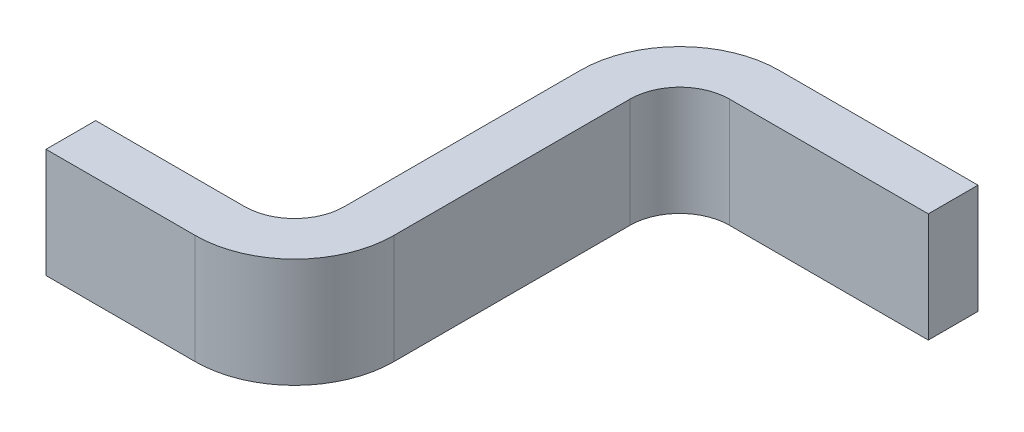
ISO-10303-21;
HEADER;
FILE_DESCRIPTION(('STEP AP214'),'2;1');
FILE_NAME('part.step','',(''),(''),'','','');
FILE_SCHEMA(('AUTOMOTIVE_DESIGN { 1 0 10303 214 1 1 1 1 }'));
ENDSEC;
DATA;
#1=APPLICATION_CONTEXT('core data for automotive mechanical design processes');
#2=APPLICATION_PROTOCOL_DEFINITION('international standard','automotive_design',2000,#1);
#3=PRODUCT_CONTEXT('',#1,'mechanical');
#4=PRODUCT('Part','Part','',(#3));
#5=PRODUCT_RELATED_PRODUCT_CATEGORY('part','',(#4));
#6=PRODUCT_DEFINITION_FORMATION('','',#4);
#7=PRODUCT_DEFINITION_CONTEXT('part definition',#1,'design');
#8=PRODUCT_DEFINITION('design','',#6,#7);
#9=PRODUCT_DEFINITION_SHAPE('','',#8);
#10=(LENGTH_UNIT() NAMED_UNIT(*) SI_UNIT(.MILLI.,.METRE.));
#11=(NAMED_UNIT(*) PLANE_ANGLE_UNIT() SI_UNIT($,.RADIAN.));
#12=(NAMED_UNIT(*) SI_UNIT($,.STERADIAN.) SOLID_ANGLE_UNIT());
#13=UNCERTAINTY_MEASURE_WITH_UNIT(LENGTH_MEASURE(1.E-05),#10,'distance_accuracy_value','');
#14=(GEOMETRIC_REPRESENTATION_CONTEXT(3) GLOBAL_UNCERTAINTY_ASSIGNED_CONTEXT((#13)) GLOBAL_UNIT_ASSIGNED_CONTEXT((#10,
#11,#12)) REPRESENTATION_CONTEXT('',''));
#15=CARTESIAN_POINT('',(0.,0.,0.));
#16=DIRECTION('',(0.,0.,1.));
#17=DIRECTION('',(1.,0.,0.));
#18=AXIS2_PLACEMENT_3D('',#15,#16,#17);
#19=CARTESIAN_POINT('',(3.90000000000001,-1.64,0.675));
#20=DIRECTION('',(0.,-1.,0.));
#21=DIRECTION('',(0.,0.,-1.));
#22=AXIS2_PLACEMENT_3D('',#19,#20,#21);
#23=PLANE('',#22);
#24=CARTESIAN_POINT('',(3.8,-1.64,0.675));
#25=DIRECTION('',(0.,-1.,0.));
#26=DIRECTION('',(0.,0.,-1.));
#27=AXIS2_PLACEMENT_3D('',#24,#25,#26);
#28=CIRCLE('',#27,0.1);
#29=CARTESIAN_POINT('',(3.90000000000001,-1.64,0.675));
#30=VERTEX_POINT('',#29);
#31=CARTESIAN_POINT('',(3.8,-1.64,0.775));
#32=VERTEX_POINT('',#31);
#33=EDGE_CURVE('E162',#30,#32,#28,.T.);
#34=ORIENTED_EDGE('',*,*,#33,.T.);
#35=DIRECTION('',(1.,0.,0.));
#36=VECTOR('',#35,1.);
#37=CARTESIAN_POINT('',(3.50000000000001,-1.64,0.775));
#38=LINE('',#37,#36);
#39=CARTESIAN_POINT('',(3.50000000000001,-1.64,0.775));
#40=VERTEX_POINT('',#39);
#41=EDGE_CURVE('E120',#32,#40,#38,.F.);
#42=ORIENTED_EDGE('',*,*,#41,.T.);
#43=DIRECTION('',(0.,0.,1.));
#44=VECTOR('',#43,1.);
#45=CARTESIAN_POINT('',(3.50000000000001,-1.64,0.775));
#46=LINE('',#45,#44);
#47=CARTESIAN_POINT('',(3.50000000000001,-1.64,0.875));
#48=VERTEX_POINT('',#47);
#49=EDGE_CURVE('E116',#48,#40,#46,.F.);
#50=ORIENTED_EDGE('',*,*,#49,.F.);
#51=DIRECTION('',(-1.,0.,0.));
#52=VECTOR('',#51,1.);
#53=CARTESIAN_POINT('',(3.50000000000001,-1.64,0.875));
#54=LINE('',#53,#52);
#55=CARTESIAN_POINT('',(3.8,-1.64,0.875));
#56=VERTEX_POINT('',#55);
#57=EDGE_CURVE('E111',#48,#56,#54,.F.);
#58=ORIENTED_EDGE('',*,*,#57,.T.);
#59=CARTESIAN_POINT('',(3.8,-1.64,0.675));
#60=DIRECTION('',(0.,-1.,0.));
#61=DIRECTION('',(0.,0.,-1.));
#62=AXIS2_PLACEMENT_3D('',#59,#60,#61);
#63=CIRCLE('',#62,0.2);
#64=CARTESIAN_POINT('',(4.,-1.64,0.675));
#65=VERTEX_POINT('',#64);
#66=EDGE_CURVE('E102',#65,#56,#63,.T.);
#67=ORIENTED_EDGE('',*,*,#66,.F.);
#68=DIRECTION('',(0.,0.,1.));
#69=VECTOR('',#68,1.);
#70=CARTESIAN_POINT('',(4.,-1.64,0.675));
#71=LINE('',#70,#69);
#72=CARTESIAN_POINT('',(4.,-1.64,0.2));
#73=VERTEX_POINT('',#72);
#74=EDGE_CURVE('E98',#65,#73,#71,.F.);
#75=ORIENTED_EDGE('',*,*,#74,.T.);
#76=CARTESIAN_POINT('',(4.1,-1.64,0.2));
#77=DIRECTION('',(0.,1.,0.));
#78=DIRECTION('',(0.,0.,1.));
#79=AXIS2_PLACEMENT_3D('',#76,#77,#78);
#80=CIRCLE('',#79,0.1);
#81=CARTESIAN_POINT('',(4.1,-1.64,0.1));
#82=VERTEX_POINT('',#81);
#83=EDGE_CURVE('E20',#73,#82,#80,.F.);
#84=ORIENTED_EDGE('',*,*,#83,.T.);
#85=DIRECTION('',(-1.,0.,0.));
#86=VECTOR('',#85,1.);
#87=CARTESIAN_POINT('',(4.1,-1.64,0.1));
#88=LINE('',#87,#86);
#89=CARTESIAN_POINT('',(4.5,-1.64,0.1));
#90=VERTEX_POINT('',#89);
#91=EDGE_CURVE('E145',#82,#90,#88,.F.);
#92=ORIENTED_EDGE('',*,*,#91,.T.);
#93=DIRECTION('',(0.,0.,1.));
#94=VECTOR('',#93,1.);
#95=CARTESIAN_POINT('',(4.5,-1.64,0.));
#96=LINE('',#95,#94);
#97=CARTESIAN_POINT('',(4.5,-1.64,0.));
#98=VERTEX_POINT('',#97);
#99=EDGE_CURVE('E139',#90,#98,#96,.F.);
#100=ORIENTED_EDGE('',*,*,#99,.T.);
#101=DIRECTION('',(1.,0.,0.));
#102=VECTOR('',#101,1.);
#103=CARTESIAN_POINT('',(4.1,-1.64,0.));
#104=LINE('',#103,#102);
#105=CARTESIAN_POINT('',(4.1,-1.64,0.));
#106=VERTEX_POINT('',#105);
#107=EDGE_CURVE('E132',#98,#106,#104,.F.);
#108=ORIENTED_EDGE('',*,*,#107,.T.);
#109=CARTESIAN_POINT('',(4.1,-1.64,0.2));
#110=DIRECTION('',(0.,1.,0.));
#111=DIRECTION('',(0.,0.,1.));
#112=AXIS2_PLACEMENT_3D('',#109,#110,#111);
#113=CIRCLE('',#112,0.2);
#114=CARTESIAN_POINT('',(3.90000000000001,-1.64,0.2));
#115=VERTEX_POINT('',#114);
#116=EDGE_CURVE('E135',#115,#106,#113,.F.);
#117=ORIENTED_EDGE('',*,*,#116,.F.);
#118=DIRECTION('',(0.,0.,-1.));
#119=VECTOR('',#118,1.);
#120=CARTESIAN_POINT('',(3.90000000000001,-1.64,0.675));
#121=LINE('',#120,#119);
#122=EDGE_CURVE('E128',#115,#30,#121,.F.);
#123=ORIENTED_EDGE('',*,*,#122,.T.);
#124=EDGE_LOOP('',(#34,#42,#50,#58,#67,#75,#84,#92,#100,#108,#117,#123));
#125=FACE_BOUND('',#124,.T.);
#126=ADVANCED_FACE('F17',(#125),#23,.F.);
#127=CARTESIAN_POINT('',(4.1,-1.64,0.2));
#128=DIRECTION('',(0.,1.,0.));
#129=DIRECTION('',(0.,0.,1.));
#130=AXIS2_PLACEMENT_3D('',#127,#128,#129);
#131=CYLINDRICAL_SURFACE('',#130,0.1);
#132=DIRECTION('',(0.,1.,0.));
#133=VECTOR('',#132,1.);
#134=CARTESIAN_POINT('',(4.,-1.64,0.2));
#135=LINE('',#134,#133);
#136=CARTESIAN_POINT('',(4.,-1.86,0.2));
#137=VERTEX_POINT('',#136);
#138=EDGE_CURVE('E91',#73,#137,#135,.F.);
#139=ORIENTED_EDGE('',*,*,#138,.T.);
#140=CARTESIAN_POINT('',(4.1,-1.86,0.2));
#141=DIRECTION('',(0.,1.,0.));
#142=DIRECTION('',(0.,0.,1.));
#143=AXIS2_PLACEMENT_3D('',#140,#141,#142);
#144=CIRCLE('',#143,0.1);
#145=CARTESIAN_POINT('',(4.1,-1.86,0.1));
#146=VERTEX_POINT('',#145);
#147=EDGE_CURVE('E103',#137,#146,#144,.F.);
#148=ORIENTED_EDGE('',*,*,#147,.T.);
#149=DIRECTION('',(0.,1.,0.));
#150=VECTOR('',#149,1.);
#151=CARTESIAN_POINT('',(4.1,-1.64,0.1));
#152=LINE('',#151,#150);
#153=EDGE_CURVE('E92',#146,#82,#152,.T.);
#154=ORIENTED_EDGE('',*,*,#153,.T.);
#155=ORIENTED_EDGE('',*,*,#83,.F.);
#156=EDGE_LOOP('',(#139,#148,#154,#155));
#157=FACE_BOUND('',#156,.T.);
#158=ADVANCED_FACE('F89',(#157),#131,.F.);
#159=CARTESIAN_POINT('',(4.1,-1.64,0.1));
#160=DIRECTION('',(0.,0.,-1.));
#161=DIRECTION('',(-1.,0.,0.));
#162=AXIS2_PLACEMENT_3D('',#159,#160,#161);
#163=PLANE('',#162);
#164=ORIENTED_EDGE('',*,*,#153,.F.);
#165=DIRECTION('',(1.,0.,0.));
#166=VECTOR('',#165,1.);
#167=CARTESIAN_POINT('',(4.,-1.86,0.1));
#168=LINE('',#167,#166);
#169=CARTESIAN_POINT('',(4.5,-1.86,0.1));
#170=VERTEX_POINT('',#169);
#171=EDGE_CURVE('E105',#146,#170,#168,.T.);
#172=ORIENTED_EDGE('',*,*,#171,.T.);
#173=DIRECTION('',(0.,1.,0.));
#174=VECTOR('',#173,1.);
#175=CARTESIAN_POINT('',(4.5,-1.86,0.1));
#176=LINE('',#175,#174);
#177=EDGE_CURVE('E142',#170,#90,#176,.T.);
#178=ORIENTED_EDGE('',*,*,#177,.T.);
#179=ORIENTED_EDGE('',*,*,#91,.F.);
#180=EDGE_LOOP('',(#164,#172,#178,#179));
#181=FACE_BOUND('',#180,.T.);
#182=ADVANCED_FACE('F187',(#181),#163,.F.);
#183=CARTESIAN_POINT('',(4.5,-1.86,0.));
#184=DIRECTION('',(-1.,0.,0.));
#185=DIRECTION('',(0.,0.,1.));
#186=AXIS2_PLACEMENT_3D('',#183,#184,#185);
#187=PLANE('',#186);
#188=ORIENTED_EDGE('',*,*,#177,.F.);
#189=DIRECTION('',(0.,0.,1.));
#190=VECTOR('',#189,1.);
#191=CARTESIAN_POINT('',(4.5,-1.86,0.675));
#192=LINE('',#191,#190);
#193=CARTESIAN_POINT('',(4.5,-1.86,0.));
#194=VERTEX_POINT('',#193);
#195=EDGE_CURVE('E176',#170,#194,#192,.F.);
#196=ORIENTED_EDGE('',*,*,#195,.T.);
#197=DIRECTION('',(0.,1.,0.));
#198=VECTOR('',#197,1.);
#199=CARTESIAN_POINT('',(4.5,-1.86,0.));
#200=LINE('',#199,#198);
#201=EDGE_CURVE('E136',#194,#98,#200,.T.);
#202=ORIENTED_EDGE('',*,*,#201,.T.);
#203=ORIENTED_EDGE('',*,*,#99,.F.);
#204=EDGE_LOOP('',(#188,#196,#202,#203));
#205=FACE_BOUND('',#204,.T.);
#206=ADVANCED_FACE('F192',(#205),#187,.F.);
#207=CARTESIAN_POINT('',(4.1,-1.86,0.));
#208=DIRECTION('',(0.,0.,1.));
#209=DIRECTION('',(1.,0.,0.));
#210=AXIS2_PLACEMENT_3D('',#207,#208,#209);
#211=PLANE('',#210);
#212=DIRECTION('',(0.,1.,0.));
#213=VECTOR('',#212,1.);
#214=CARTESIAN_POINT('',(4.1,-1.86,0.));
#215=LINE('',#214,#213);
#216=CARTESIAN_POINT('',(4.1,-1.86,0.));
#217=VERTEX_POINT('',#216);
#218=EDGE_CURVE('E163',#106,#217,#215,.F.);
#219=ORIENTED_EDGE('',*,*,#218,.F.);
#220=ORIENTED_EDGE('',*,*,#107,.F.);
#221=ORIENTED_EDGE('',*,*,#201,.F.);
#222=DIRECTION('',(1.,0.,0.));
#223=VECTOR('',#222,1.);
#224=CARTESIAN_POINT('',(4.,-1.86,0.));
#225=LINE('',#224,#223);
#226=EDGE_CURVE('E159',#194,#217,#225,.F.);
#227=ORIENTED_EDGE('',*,*,#226,.T.);
#228=EDGE_LOOP('',(#219,#220,#221,#227));
#229=FACE_BOUND('',#228,.T.);
#230=ADVANCED_FACE('F264',(#229),#211,.F.);
#231=CARTESIAN_POINT('',(4.1,-1.86,0.2));
#232=DIRECTION('',(0.,1.,0.));
#233=DIRECTION('',(0.,0.,1.));
#234=AXIS2_PLACEMENT_3D('',#231,#232,#233);
#235=CYLINDRICAL_SURFACE('',#234,0.2);
#236=ORIENTED_EDGE('',*,*,#116,.T.);
#237=ORIENTED_EDGE('',*,*,#218,.T.);
#238=CARTESIAN_POINT('',(4.1,-1.86,0.2));
#239=DIRECTION('',(0.,1.,0.));
#240=DIRECTION('',(0.,0.,1.));
#241=AXIS2_PLACEMENT_3D('',#238,#239,#240);
#242=CIRCLE('',#241,0.2);
#243=CARTESIAN_POINT('',(3.9,-1.86,0.2));
#244=VERTEX_POINT('',#243);
#245=EDGE_CURVE('E157',#217,#244,#242,.T.);
#246=ORIENTED_EDGE('',*,*,#245,.T.);
#247=DIRECTION('',(0.,1.,0.));
#248=VECTOR('',#247,1.);
#249=CARTESIAN_POINT('',(3.9,-1.86,0.2));
#250=LINE('',#249,#248);
#251=EDGE_CURVE('E131',#244,#115,#250,.T.);
#252=ORIENTED_EDGE('',*,*,#251,.T.);
#253=EDGE_LOOP('',(#236,#237,#246,#252));
#254=FACE_BOUND('',#253,.T.);
#255=ADVANCED_FACE('F266',(#254),#235,.T.);
#256=CARTESIAN_POINT('',(3.9,-1.86,0.675));
#257=DIRECTION('',(1.,0.,0.));
#258=DIRECTION('',(0.,0.,-1.));
#259=AXIS2_PLACEMENT_3D('',#256,#257,#258);
#260=PLANE('',#259);
#261=DIRECTION('',(0.,-1.,0.));
#262=VECTOR('',#261,1.);
#263=CARTESIAN_POINT('',(3.9,-1.86,0.675));
#264=LINE('',#263,#262);
#265=CARTESIAN_POINT('',(3.9,-1.86,0.675));
#266=VERTEX_POINT('',#265);
#267=EDGE_CURVE('E130',#266,#30,#264,.F.);
#268=ORIENTED_EDGE('',*,*,#267,.T.);
#269=ORIENTED_EDGE('',*,*,#122,.F.);
#270=ORIENTED_EDGE('',*,*,#251,.F.);
#271=DIRECTION('',(0.,0.,1.));
#272=VECTOR('',#271,1.);
#273=CARTESIAN_POINT('',(3.9,-1.86,0.675));
#274=LINE('',#273,#272);
#275=EDGE_CURVE('E156',#244,#266,#274,.T.);
#276=ORIENTED_EDGE('',*,*,#275,.T.);
#277=EDGE_LOOP('',(#268,#269,#270,#276));
#278=FACE_BOUND('',#277,.T.);
#279=ADVANCED_FACE('F231',(#278),#260,.F.);
#280=CARTESIAN_POINT('',(3.8,-1.86,0.675));
#281=DIRECTION('',(0.,-1.,0.));
#282=DIRECTION('',(0.,0.,-1.));
#283=AXIS2_PLACEMENT_3D('',#280,#281,#282);
#284=CYLINDRICAL_SURFACE('',#283,0.1);
#285=DIRECTION('',(0.,1.,0.));
#286=VECTOR('',#285,1.);
#287=CARTESIAN_POINT('',(3.8,-1.86,0.775));
#288=LINE('',#287,#286);
#289=CARTESIAN_POINT('',(3.8,-1.86,0.775));
#290=VERTEX_POINT('',#289);
#291=EDGE_CURVE('E125',#290,#32,#288,.T.);
#292=ORIENTED_EDGE('',*,*,#291,.T.);
#293=ORIENTED_EDGE('',*,*,#33,.F.);
#294=ORIENTED_EDGE('',*,*,#267,.F.);
#295=CARTESIAN_POINT('',(3.8,-1.86,0.675));
#296=DIRECTION('',(0.,-1.,0.));
#297=DIRECTION('',(0.,0.,-1.));
#298=AXIS2_PLACEMENT_3D('',#295,#296,#297);
#299=CIRCLE('',#298,0.1);
#300=EDGE_CURVE('E152',#266,#290,#299,.T.);
#301=ORIENTED_EDGE('',*,*,#300,.T.);
#302=EDGE_LOOP('',(#292,#293,#294,#301));
#303=FACE_BOUND('',#302,.T.);
#304=ADVANCED_FACE('F235',(#303),#284,.F.);
#305=CARTESIAN_POINT('',(3.50000000000001,-1.86,0.775));
#306=DIRECTION('',(0.,0.,1.));
#307=DIRECTION('',(1.,0.,0.));
#308=AXIS2_PLACEMENT_3D('',#305,#306,#307);
#309=PLANE('',#308);
#310=DIRECTION('',(0.,1.,0.));
#311=VECTOR('',#310,1.);
#312=CARTESIAN_POINT('',(3.50000000000001,-1.86,0.775));
#313=LINE('',#312,#311);
#314=CARTESIAN_POINT('',(3.50000000000001,-1.86,0.775));
#315=VERTEX_POINT('',#314);
#316=EDGE_CURVE('E119',#40,#315,#313,.F.);
#317=ORIENTED_EDGE('',*,*,#316,.F.);
#318=ORIENTED_EDGE('',*,*,#41,.F.);
#319=ORIENTED_EDGE('',*,*,#291,.F.);
#320=DIRECTION('',(1.,0.,0.));
#321=VECTOR('',#320,1.);
#322=CARTESIAN_POINT('',(4.,-1.86,0.775));
#323=LINE('',#322,#321);
#324=EDGE_CURVE('E155',#290,#315,#323,.F.);
#325=ORIENTED_EDGE('',*,*,#324,.T.);
#326=EDGE_LOOP('',(#317,#318,#319,#325));
#327=FACE_BOUND('',#326,.T.);
#328=ADVANCED_FACE('F259',(#327),#309,.F.);
#329=CARTESIAN_POINT('',(3.50000000000001,-1.86,0.775));
#330=DIRECTION('',(-1.,0.,0.));
#331=DIRECTION('',(0.,0.,1.));
#332=AXIS2_PLACEMENT_3D('',#329,#330,#331);
#333=PLANE('',#332);
#334=DIRECTION('',(0.,0.,1.));
#335=VECTOR('',#334,1.);
#336=CARTESIAN_POINT('',(3.50000000000001,-1.86,0.675));
#337=LINE('',#336,#335);
#338=CARTESIAN_POINT('',(3.50000000000001,-1.86,0.875));
#339=VERTEX_POINT('',#338);
#340=EDGE_CURVE('E217',#315,#339,#337,.T.);
#341=ORIENTED_EDGE('',*,*,#340,.T.);
#342=DIRECTION('',(0.,1.,0.));
#343=VECTOR('',#342,1.);
#344=CARTESIAN_POINT('',(3.50000000000001,-1.64,0.875));
#345=LINE('',#344,#343);
#346=EDGE_CURVE('E113',#339,#48,#345,.T.);
#347=ORIENTED_EDGE('',*,*,#346,.T.);
#348=ORIENTED_EDGE('',*,*,#49,.T.);
#349=ORIENTED_EDGE('',*,*,#316,.T.);
#350=EDGE_LOOP('',(#341,#347,#348,#349));
#351=FACE_BOUND('',#350,.T.);
#352=ADVANCED_FACE('F255',(#351),#333,.T.);
#353=CARTESIAN_POINT('',(3.50000000000001,-1.64,0.875));
#354=DIRECTION('',(0.,0.,-1.));
#355=DIRECTION('',(-1.,0.,0.));
#356=AXIS2_PLACEMENT_3D('',#353,#354,#355);
#357=PLANE('',#356);
#358=ORIENTED_EDGE('',*,*,#346,.F.);
#359=DIRECTION('',(1.,0.,0.));
#360=VECTOR('',#359,1.);
#361=CARTESIAN_POINT('',(4.,-1.86,0.875));
#362=LINE('',#361,#360);
#363=CARTESIAN_POINT('',(3.8,-1.86,0.875));
#364=VERTEX_POINT('',#363);
#365=EDGE_CURVE('E151',#339,#364,#362,.T.);
#366=ORIENTED_EDGE('',*,*,#365,.T.);
#367=DIRECTION('',(0.,-1.,0.));
#368=VECTOR('',#367,1.);
#369=CARTESIAN_POINT('',(3.8,-1.64,0.875));
#370=LINE('',#369,#368);
#371=EDGE_CURVE('E99',#56,#364,#370,.T.);
#372=ORIENTED_EDGE('',*,*,#371,.F.);
#373=ORIENTED_EDGE('',*,*,#57,.F.);
#374=EDGE_LOOP('',(#358,#366,#372,#373));
#375=FACE_BOUND('',#374,.T.);
#376=ADVANCED_FACE('F251',(#375),#357,.F.);
#377=CARTESIAN_POINT('',(3.8,-1.64,0.675));
#378=DIRECTION('',(0.,-1.,0.));
#379=DIRECTION('',(0.,0.,-1.));
#380=AXIS2_PLACEMENT_3D('',#377,#378,#379);
#381=CYLINDRICAL_SURFACE('',#380,0.2);
#382=CARTESIAN_POINT('',(3.8,-1.86,0.675));
#383=DIRECTION('',(0.,-1.,0.));
#384=DIRECTION('',(0.,0.,-1.));
#385=AXIS2_PLACEMENT_3D('',#382,#383,#384);
#386=CIRCLE('',#385,0.2);
#387=CARTESIAN_POINT('',(4.,-1.86,0.675));
#388=VERTEX_POINT('',#387);
#389=EDGE_CURVE('E26',#364,#388,#386,.F.);
#390=ORIENTED_EDGE('',*,*,#389,.T.);
#391=DIRECTION('',(0.,1.,0.));
#392=VECTOR('',#391,1.);
#393=CARTESIAN_POINT('',(4.,-1.64,0.675));
#394=LINE('',#393,#392);
#395=EDGE_CURVE('E34',#388,#65,#394,.T.);
#396=ORIENTED_EDGE('',*,*,#395,.T.);
#397=ORIENTED_EDGE('',*,*,#66,.T.);
#398=ORIENTED_EDGE('',*,*,#371,.T.);
#399=EDGE_LOOP('',(#390,#396,#397,#398));
#400=FACE_BOUND('',#399,.T.);
#401=ADVANCED_FACE('F280',(#400),#381,.T.);
#402=CARTESIAN_POINT('',(4.,-1.64,0.675));
#403=DIRECTION('',(-1.,0.,0.));
#404=DIRECTION('',(0.,0.,1.));
#405=AXIS2_PLACEMENT_3D('',#402,#403,#404);
#406=PLANE('',#405);
#407=ORIENTED_EDGE('',*,*,#395,.F.);
#408=DIRECTION('',(0.,0.,1.));
#409=VECTOR('',#408,1.);
#410=CARTESIAN_POINT('',(4.,-1.86,0.675));
#411=LINE('',#410,#409);
#412=EDGE_CURVE('E11',#388,#137,#411,.F.);
#413=ORIENTED_EDGE('',*,*,#412,.T.);
#414=ORIENTED_EDGE('',*,*,#138,.F.);
#415=ORIENTED_EDGE('',*,*,#74,.F.);
#416=EDGE_LOOP('',(#407,#413,#414,#415));
#417=FACE_BOUND('',#416,.T.);
#418=ADVANCED_FACE('F97',(#417),#406,.F.);
#419=CARTESIAN_POINT('',(4.,-1.86,0.675));
#420=DIRECTION('',(0.,1.,0.));
#421=DIRECTION('',(0.,0.,1.));
#422=AXIS2_PLACEMENT_3D('',#419,#420,#421);
#423=PLANE('',#422);
#424=ORIENTED_EDGE('',*,*,#389,.F.);
#425=ORIENTED_EDGE('',*,*,#365,.F.);
#426=ORIENTED_EDGE('',*,*,#340,.F.);
#427=ORIENTED_EDGE('',*,*,#324,.F.);
#428=ORIENTED_EDGE('',*,*,#300,.F.);
#429=ORIENTED_EDGE('',*,*,#275,.F.);
#430=ORIENTED_EDGE('',*,*,#245,.F.);
#431=ORIENTED_EDGE('',*,*,#226,.F.);
#432=ORIENTED_EDGE('',*,*,#195,.F.);
#433=ORIENTED_EDGE('',*,*,#171,.F.);
#434=ORIENTED_EDGE('',*,*,#147,.F.);
#435=ORIENTED_EDGE('',*,*,#412,.F.);
#436=EDGE_LOOP('',(#424,#425,#426,#427,#428,#429,#430,#431,#432,#433,#434,#435));
#437=FACE_BOUND('',#436,.T.);
#438=ADVANCED_FACE('F197',(#437),#423,.F.);
#439=CLOSED_SHELL('',(#126,#158,#182,#206,#230,#255,#279,#304,#328,#352,#376,#401,#418,#438));
#440=MANIFOLD_SOLID_BREP('B1',#439);
#441=ADVANCED_BREP_SHAPE_REPRESENTATION('',(#18,#440),#14);
#442=SHAPE_DEFINITION_REPRESENTATION(#9,#441);
ENDSEC;
END-ISO-10303-21;
